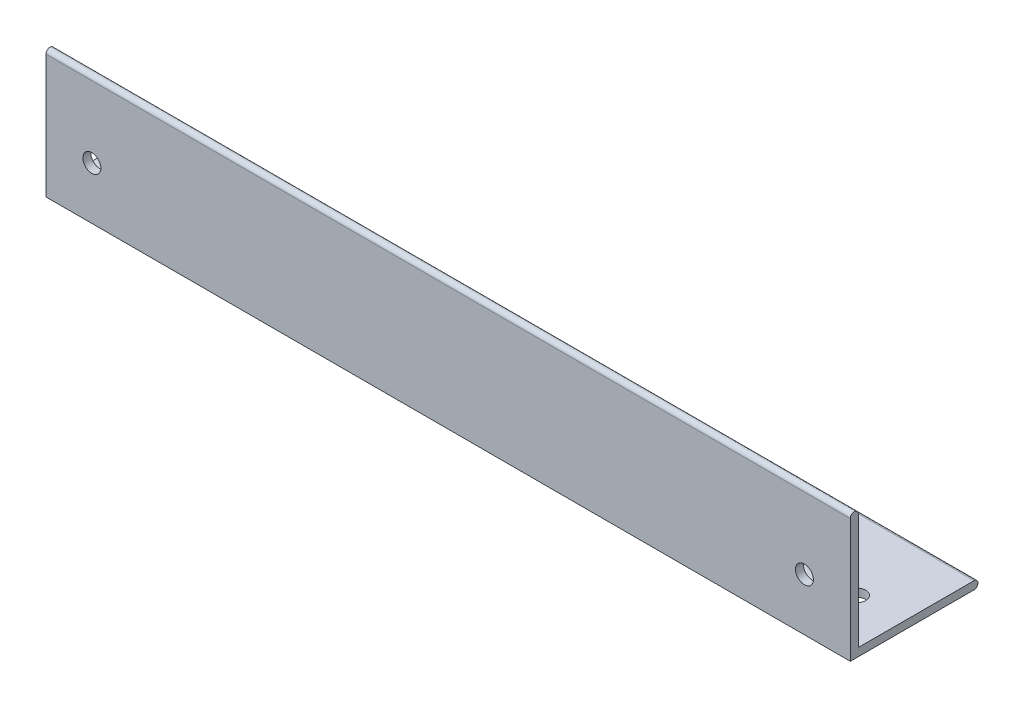
ISO-10303-21;
HEADER;
FILE_DESCRIPTION(('STEP AP214'),'2;1');
FILE_NAME('part.step','',(''),(''),'','','');
FILE_SCHEMA(('AUTOMOTIVE_DESIGN { 1 0 10303 214 1 1 1 1 }'));
ENDSEC;
DATA;
#1=APPLICATION_CONTEXT('core data for automotive mechanical design processes');
#2=APPLICATION_PROTOCOL_DEFINITION('international standard','automotive_design',2000,#1);
#3=PRODUCT_CONTEXT('',#1,'mechanical');
#4=PRODUCT('Part','Part','',(#3));
#5=PRODUCT_RELATED_PRODUCT_CATEGORY('part','',(#4));
#6=PRODUCT_DEFINITION_FORMATION('','',#4);
#7=PRODUCT_DEFINITION_CONTEXT('part definition',#1,'design');
#8=PRODUCT_DEFINITION('design','',#6,#7);
#9=PRODUCT_DEFINITION_SHAPE('','',#8);
#10=(LENGTH_UNIT() NAMED_UNIT(*) SI_UNIT(.MILLI.,.METRE.));
#11=(NAMED_UNIT(*) PLANE_ANGLE_UNIT() SI_UNIT($,.RADIAN.));
#12=(NAMED_UNIT(*) SI_UNIT($,.STERADIAN.) SOLID_ANGLE_UNIT());
#13=UNCERTAINTY_MEASURE_WITH_UNIT(LENGTH_MEASURE(1.E-05),#10,'distance_accuracy_value','');
#14=(GEOMETRIC_REPRESENTATION_CONTEXT(3) GLOBAL_UNCERTAINTY_ASSIGNED_CONTEXT((#13)) GLOBAL_UNIT_ASSIGNED_CONTEXT((#10,
#11,#12)) REPRESENTATION_CONTEXT('',''));
#15=CARTESIAN_POINT('',(0.,0.,0.));
#16=DIRECTION('',(0.,0.,1.));
#17=DIRECTION('',(1.,0.,0.));
#18=AXIS2_PLACEMENT_3D('',#15,#16,#17);
#19=CARTESIAN_POINT('',(160.,0.793749999999999,-24.60625));
#20=DIRECTION('',(-1.,0.,0.));
#21=DIRECTION('',(0.,0.,1.));
#22=AXIS2_PLACEMENT_3D('',#19,#20,#21);
#23=CYLINDRICAL_SURFACE('',#22,0.793749999999999);
#24=DIRECTION('',(-1.,0.,0.));
#25=VECTOR('',#24,1.);
#26=CARTESIAN_POINT('',(160.,1.5875,-24.60625));
#27=LINE('',#26,#25);
#28=CARTESIAN_POINT('',(160.,1.5875,-24.60625));
#29=VERTEX_POINT('',#28);
#30=CARTESIAN_POINT('',(0.,1.5875,-24.60625));
#31=VERTEX_POINT('',#30);
#32=EDGE_CURVE('E154',#29,#31,#27,.T.);
#33=ORIENTED_EDGE('',*,*,#32,.F.);
#34=CARTESIAN_POINT('',(160.,0.793749999999999,-24.60625));
#35=DIRECTION('',(-1.,0.,0.));
#36=DIRECTION('',(0.,0.,1.));
#37=AXIS2_PLACEMENT_3D('',#34,#35,#36);
#38=CIRCLE('',#37,0.793749999999999);
#39=CARTESIAN_POINT('',(160.,0.,-24.60625));
#40=VERTEX_POINT('',#39);
#41=EDGE_CURVE('E51',#40,#29,#38,.F.);
#42=ORIENTED_EDGE('',*,*,#41,.F.);
#43=DIRECTION('',(-1.,0.,0.));
#44=VECTOR('',#43,1.);
#45=CARTESIAN_POINT('',(160.,0.,-24.60625));
#46=LINE('',#45,#44);
#47=CARTESIAN_POINT('',(0.,0.,-24.60625));
#48=VERTEX_POINT('',#47);
#49=EDGE_CURVE('E157',#48,#40,#46,.F.);
#50=ORIENTED_EDGE('',*,*,#49,.F.);
#51=CARTESIAN_POINT('',(0.,0.793749999999999,-24.60625));
#52=DIRECTION('',(-1.,0.,0.));
#53=DIRECTION('',(0.,0.,1.));
#54=AXIS2_PLACEMENT_3D('',#51,#52,#53);
#55=CIRCLE('',#54,0.793749999999999);
#56=EDGE_CURVE('E11',#31,#48,#55,.T.);
#57=ORIENTED_EDGE('',*,*,#56,.F.);
#58=EDGE_LOOP('',(#33,#42,#50,#57));
#59=FACE_BOUND('',#58,.T.);
#60=ADVANCED_FACE('F41',(#59),#23,.T.);
#61=CARTESIAN_POINT('',(160.,24.60625,-0.79375));
#62=DIRECTION('',(-1.,0.,0.));
#63=DIRECTION('',(0.,0.,1.));
#64=AXIS2_PLACEMENT_3D('',#61,#62,#63);
#65=CYLINDRICAL_SURFACE('',#64,0.79375);
#66=DIRECTION('',(-1.,0.,0.));
#67=VECTOR('',#66,1.);
#68=CARTESIAN_POINT('',(160.,24.60625,0.));
#69=LINE('',#68,#67);
#70=CARTESIAN_POINT('',(160.,24.60625,0.));
#71=VERTEX_POINT('',#70);
#72=CARTESIAN_POINT('',(0.,24.60625,0.));
#73=VERTEX_POINT('',#72);
#74=EDGE_CURVE('E114',#71,#73,#69,.T.);
#75=ORIENTED_EDGE('',*,*,#74,.F.);
#76=CARTESIAN_POINT('',(160.,24.60625,-0.79375));
#77=DIRECTION('',(-1.,0.,0.));
#78=DIRECTION('',(0.,0.,1.));
#79=AXIS2_PLACEMENT_3D('',#76,#77,#78);
#80=CIRCLE('',#79,0.79375);
#81=CARTESIAN_POINT('',(160.,24.60625,-1.5875));
#82=VERTEX_POINT('',#81);
#83=EDGE_CURVE('E148',#82,#71,#80,.F.);
#84=ORIENTED_EDGE('',*,*,#83,.F.);
#85=DIRECTION('',(-1.,0.,0.));
#86=VECTOR('',#85,1.);
#87=CARTESIAN_POINT('',(160.,24.60625,-1.5875));
#88=LINE('',#87,#86);
#89=CARTESIAN_POINT('',(0.,24.60625,-1.5875));
#90=VERTEX_POINT('',#89);
#91=EDGE_CURVE('E120',#90,#82,#88,.F.);
#92=ORIENTED_EDGE('',*,*,#91,.F.);
#93=CARTESIAN_POINT('',(0.,24.60625,-0.79375));
#94=DIRECTION('',(-1.,0.,0.));
#95=DIRECTION('',(0.,0.,1.));
#96=AXIS2_PLACEMENT_3D('',#93,#94,#95);
#97=CIRCLE('',#96,0.79375);
#98=EDGE_CURVE('E151',#73,#90,#97,.T.);
#99=ORIENTED_EDGE('',*,*,#98,.F.);
#100=EDGE_LOOP('',(#75,#84,#92,#99));
#101=FACE_BOUND('',#100,.T.);
#102=ADVANCED_FACE('F192',(#101),#65,.T.);
#103=CARTESIAN_POINT('',(160.,0.,-25.4));
#104=DIRECTION('',(0.,1.,0.));
#105=DIRECTION('',(0.,0.,1.));
#106=AXIS2_PLACEMENT_3D('',#103,#104,#105);
#107=PLANE('',#106);
#108=CARTESIAN_POINT('',(9.13,0.,-10.41));
#109=DIRECTION('',(0.,-1.,0.));
#110=DIRECTION('',(0.,0.,1.));
#111=AXIS2_PLACEMENT_3D('',#108,#109,#110);
#112=CIRCLE('',#111,1.785);
#113=CARTESIAN_POINT('',(9.13,0.,-8.625));
#114=VERTEX_POINT('',#113);
#115=EDGE_CURVE('E164',#114,#114,#112,.T.);
#116=ORIENTED_EDGE('',*,*,#115,.F.);
#117=EDGE_LOOP('',(#116));
#118=FACE_BOUND('',#117,.T.);
#119=CARTESIAN_POINT('',(150.87,0.,-10.41));
#120=DIRECTION('',(0.,-1.,0.));
#121=DIRECTION('',(0.,0.,-1.));
#122=AXIS2_PLACEMENT_3D('',#119,#120,#121);
#123=CIRCLE('',#122,1.78500000000001);
#124=CARTESIAN_POINT('',(150.87,0.,-12.195));
#125=VERTEX_POINT('',#124);
#126=EDGE_CURVE('E171',#125,#125,#123,.T.);
#127=ORIENTED_EDGE('',*,*,#126,.F.);
#128=EDGE_LOOP('',(#127));
#129=FACE_BOUND('',#128,.T.);
#130=DIRECTION('',(0.,0.,-1.));
#131=VECTOR('',#130,1.);
#132=CARTESIAN_POINT('',(0.,0.,-25.4));
#133=LINE('',#132,#131);
#134=CARTESIAN_POINT('',(0.,0.,0.));
#135=VERTEX_POINT('',#134);
#136=EDGE_CURVE('E128',#135,#48,#133,.T.);
#137=ORIENTED_EDGE('',*,*,#136,.T.);
#138=ORIENTED_EDGE('',*,*,#49,.T.);
#139=DIRECTION('',(0.,0.,-1.));
#140=VECTOR('',#139,1.);
#141=CARTESIAN_POINT('',(160.,0.,-25.4));
#142=LINE('',#141,#140);
#143=CARTESIAN_POINT('',(160.,0.,0.));
#144=VERTEX_POINT('',#143);
#145=EDGE_CURVE('E104',#144,#40,#142,.T.);
#146=ORIENTED_EDGE('',*,*,#145,.F.);
#147=DIRECTION('',(-1.,0.,0.));
#148=VECTOR('',#147,1.);
#149=CARTESIAN_POINT('',(160.,0.,0.));
#150=LINE('',#149,#148);
#151=EDGE_CURVE('E115',#144,#135,#150,.T.);
#152=ORIENTED_EDGE('',*,*,#151,.T.);
#153=EDGE_LOOP('',(#137,#138,#146,#152));
#154=FACE_BOUND('',#153,.T.);
#155=ADVANCED_FACE('F187',(#118,#129,#154),#107,.F.);
#156=CARTESIAN_POINT('',(160.,1.5875,-1.5875));
#157=DIRECTION('',(0.,-1.,0.));
#158=DIRECTION('',(0.,0.,-1.));
#159=AXIS2_PLACEMENT_3D('',#156,#157,#158);
#160=PLANE('',#159);
#161=CARTESIAN_POINT('',(9.13,1.5875,-10.41));
#162=DIRECTION('',(0.,-1.,0.));
#163=DIRECTION('',(0.,0.,-1.));
#164=AXIS2_PLACEMENT_3D('',#161,#162,#163);
#165=CIRCLE('',#164,1.785);
#166=CARTESIAN_POINT('',(9.13,1.5875,-12.195));
#167=VERTEX_POINT('',#166);
#168=EDGE_CURVE('E45',#167,#167,#165,.T.);
#169=ORIENTED_EDGE('',*,*,#168,.T.);
#170=EDGE_LOOP('',(#169));
#171=FACE_BOUND('',#170,.T.);
#172=CARTESIAN_POINT('',(150.87,1.5875,-10.41));
#173=DIRECTION('',(0.,-1.,0.));
#174=DIRECTION('',(0.,0.,-1.));
#175=AXIS2_PLACEMENT_3D('',#172,#173,#174);
#176=CIRCLE('',#175,1.78500000000001);
#177=CARTESIAN_POINT('',(150.87,1.5875,-12.195));
#178=VERTEX_POINT('',#177);
#179=EDGE_CURVE('E161',#178,#178,#176,.T.);
#180=ORIENTED_EDGE('',*,*,#179,.T.);
#181=EDGE_LOOP('',(#180));
#182=FACE_BOUND('',#181,.T.);
#183=DIRECTION('',(0.,0.,1.));
#184=VECTOR('',#183,1.);
#185=CARTESIAN_POINT('',(160.,1.5875,-1.5875));
#186=LINE('',#185,#184);
#187=CARTESIAN_POINT('',(160.,1.5875,-1.5875));
#188=VERTEX_POINT('',#187);
#189=EDGE_CURVE('E95',#29,#188,#186,.T.);
#190=ORIENTED_EDGE('',*,*,#189,.F.);
#191=ORIENTED_EDGE('',*,*,#32,.T.);
#192=DIRECTION('',(0.,0.,1.));
#193=VECTOR('',#192,1.);
#194=CARTESIAN_POINT('',(0.,1.5875,-1.5875));
#195=LINE('',#194,#193);
#196=CARTESIAN_POINT('',(0.,1.5875,-1.5875));
#197=VERTEX_POINT('',#196);
#198=EDGE_CURVE('E109',#31,#197,#195,.T.);
#199=ORIENTED_EDGE('',*,*,#198,.T.);
#200=DIRECTION('',(-1.,0.,0.));
#201=VECTOR('',#200,1.);
#202=CARTESIAN_POINT('',(160.,1.5875,-1.5875));
#203=LINE('',#202,#201);
#204=EDGE_CURVE('E107',#188,#197,#203,.T.);
#205=ORIENTED_EDGE('',*,*,#204,.F.);
#206=EDGE_LOOP('',(#190,#191,#199,#205));
#207=FACE_BOUND('',#206,.T.);
#208=ADVANCED_FACE('F108',(#171,#182,#207),#160,.F.);
#209=CARTESIAN_POINT('',(160.,25.4,-1.5875));
#210=DIRECTION('',(0.,0.,1.));
#211=DIRECTION('',(0.,-1.,0.));
#212=AXIS2_PLACEMENT_3D('',#209,#210,#211);
#213=PLANE('',#212);
#214=CARTESIAN_POINT('',(9.13,10.41,-1.5875));
#215=DIRECTION('',(0.,0.,1.));
#216=DIRECTION('',(0.,1.,0.));
#217=AXIS2_PLACEMENT_3D('',#214,#215,#216);
#218=CIRCLE('',#217,1.78500000000001);
#219=CARTESIAN_POINT('',(9.13,12.195,-1.5875));
#220=VERTEX_POINT('',#219);
#221=EDGE_CURVE('E293',#220,#220,#218,.T.);
#222=ORIENTED_EDGE('',*,*,#221,.T.);
#223=EDGE_LOOP('',(#222));
#224=FACE_BOUND('',#223,.T.);
#225=CARTESIAN_POINT('',(150.87,10.41,-1.5875));
#226=DIRECTION('',(0.,0.,-1.));
#227=DIRECTION('',(0.,1.,0.));
#228=AXIS2_PLACEMENT_3D('',#225,#226,#227);
#229=CIRCLE('',#228,1.78500000000001);
#230=CARTESIAN_POINT('',(150.87,12.195,-1.5875));
#231=VERTEX_POINT('',#230);
#232=EDGE_CURVE('E180',#231,#231,#229,.T.);
#233=ORIENTED_EDGE('',*,*,#232,.F.);
#234=EDGE_LOOP('',(#233));
#235=FACE_BOUND('',#234,.T.);
#236=DIRECTION('',(0.,1.,0.));
#237=VECTOR('',#236,1.);
#238=CARTESIAN_POINT('',(0.,25.4,-1.5875));
#239=LINE('',#238,#237);
#240=EDGE_CURVE('E134',#197,#90,#239,.T.);
#241=ORIENTED_EDGE('',*,*,#240,.T.);
#242=ORIENTED_EDGE('',*,*,#91,.T.);
#243=DIRECTION('',(0.,1.,0.));
#244=VECTOR('',#243,1.);
#245=CARTESIAN_POINT('',(160.,25.4,-1.5875));
#246=LINE('',#245,#244);
#247=EDGE_CURVE('E100',#188,#82,#246,.T.);
#248=ORIENTED_EDGE('',*,*,#247,.F.);
#249=ORIENTED_EDGE('',*,*,#204,.T.);
#250=EDGE_LOOP('',(#241,#242,#248,#249));
#251=FACE_BOUND('',#250,.T.);
#252=ADVANCED_FACE('F118',(#224,#235,#251),#213,.F.);
#253=CARTESIAN_POINT('',(160.,0.,0.));
#254=DIRECTION('',(0.,0.,-1.));
#255=DIRECTION('',(-1.,0.,0.));
#256=AXIS2_PLACEMENT_3D('',#253,#254,#255);
#257=PLANE('',#256);
#258=CARTESIAN_POINT('',(9.13,10.41,0.));
#259=DIRECTION('',(0.,0.,1.));
#260=DIRECTION('',(0.,1.,0.));
#261=AXIS2_PLACEMENT_3D('',#258,#259,#260);
#262=CIRCLE('',#261,1.78500000000001);
#263=CARTESIAN_POINT('',(9.13,12.195,0.));
#264=VERTEX_POINT('',#263);
#265=EDGE_CURVE('E290',#264,#264,#262,.T.);
#266=ORIENTED_EDGE('',*,*,#265,.F.);
#267=EDGE_LOOP('',(#266));
#268=FACE_BOUND('',#267,.T.);
#269=CARTESIAN_POINT('',(150.87,10.41,0.));
#270=DIRECTION('',(0.,0.,-1.));
#271=DIRECTION('',(0.,1.,0.));
#272=AXIS2_PLACEMENT_3D('',#269,#270,#271);
#273=CIRCLE('',#272,1.78500000000001);
#274=CARTESIAN_POINT('',(150.87,12.195,0.));
#275=VERTEX_POINT('',#274);
#276=EDGE_CURVE('E177',#275,#275,#273,.T.);
#277=ORIENTED_EDGE('',*,*,#276,.T.);
#278=EDGE_LOOP('',(#277));
#279=FACE_BOUND('',#278,.T.);
#280=DIRECTION('',(0.,-1.,0.));
#281=VECTOR('',#280,1.);
#282=CARTESIAN_POINT('',(160.,0.,0.));
#283=LINE('',#282,#281);
#284=EDGE_CURVE('E122',#71,#144,#283,.T.);
#285=ORIENTED_EDGE('',*,*,#284,.F.);
#286=ORIENTED_EDGE('',*,*,#74,.T.);
#287=DIRECTION('',(0.,-1.,0.));
#288=VECTOR('',#287,1.);
#289=CARTESIAN_POINT('',(0.,0.,0.));
#290=LINE('',#289,#288);
#291=EDGE_CURVE('E137',#73,#135,#290,.T.);
#292=ORIENTED_EDGE('',*,*,#291,.T.);
#293=ORIENTED_EDGE('',*,*,#151,.F.);
#294=EDGE_LOOP('',(#285,#286,#292,#293));
#295=FACE_BOUND('',#294,.T.);
#296=ADVANCED_FACE('F194',(#268,#279,#295),#257,.F.);
#297=CARTESIAN_POINT('',(160.,0.,0.));
#298=DIRECTION('',(-1.,0.,0.));
#299=DIRECTION('',(0.,0.,1.));
#300=AXIS2_PLACEMENT_3D('',#297,#298,#299);
#301=PLANE('',#300);
#302=ORIENTED_EDGE('',*,*,#145,.T.);
#303=ORIENTED_EDGE('',*,*,#41,.T.);
#304=ORIENTED_EDGE('',*,*,#189,.T.);
#305=ORIENTED_EDGE('',*,*,#247,.T.);
#306=ORIENTED_EDGE('',*,*,#83,.T.);
#307=ORIENTED_EDGE('',*,*,#284,.T.);
#308=EDGE_LOOP('',(#302,#303,#304,#305,#306,#307));
#309=FACE_BOUND('',#308,.T.);
#310=ADVANCED_FACE('F98',(#309),#301,.F.);
#311=CARTESIAN_POINT('',(0.,0.,0.));
#312=DIRECTION('',(-1.,0.,0.));
#313=DIRECTION('',(0.,0.,1.));
#314=AXIS2_PLACEMENT_3D('',#311,#312,#313);
#315=PLANE('',#314);
#316=ORIENTED_EDGE('',*,*,#198,.F.);
#317=ORIENTED_EDGE('',*,*,#56,.T.);
#318=ORIENTED_EDGE('',*,*,#136,.F.);
#319=ORIENTED_EDGE('',*,*,#291,.F.);
#320=ORIENTED_EDGE('',*,*,#98,.T.);
#321=ORIENTED_EDGE('',*,*,#240,.F.);
#322=EDGE_LOOP('',(#316,#317,#318,#319,#320,#321));
#323=FACE_BOUND('',#322,.T.);
#324=ADVANCED_FACE('F188',(#323),#315,.T.);
#325=CARTESIAN_POINT('',(150.87,25.4,-10.41));
#326=DIRECTION('',(0.,-1.,0.));
#327=DIRECTION('',(0.,0.,-1.));
#328=AXIS2_PLACEMENT_3D('',#325,#326,#327);
#329=CYLINDRICAL_SURFACE('',#328,1.78500000000001);
#330=ORIENTED_EDGE('',*,*,#126,.T.);
#331=EDGE_LOOP('',(#330));
#332=FACE_BOUND('',#331,.T.);
#333=ORIENTED_EDGE('',*,*,#179,.F.);
#334=EDGE_LOOP('',(#333));
#335=FACE_BOUND('',#334,.T.);
#336=ADVANCED_FACE('F230',(#332,#335),#329,.F.);
#337=CARTESIAN_POINT('',(9.13,25.4,-10.41));
#338=DIRECTION('',(0.,-1.,0.));
#339=DIRECTION('',(0.,0.,-1.));
#340=AXIS2_PLACEMENT_3D('',#337,#338,#339);
#341=CYLINDRICAL_SURFACE('',#340,1.785);
#342=ORIENTED_EDGE('',*,*,#115,.T.);
#343=EDGE_LOOP('',(#342));
#344=FACE_BOUND('',#343,.T.);
#345=ORIENTED_EDGE('',*,*,#168,.F.);
#346=EDGE_LOOP('',(#345));
#347=FACE_BOUND('',#346,.T.);
#348=ADVANCED_FACE('F227',(#344,#347),#341,.F.);
#349=CARTESIAN_POINT('',(150.87,10.41,0.));
#350=DIRECTION('',(0.,0.,-1.));
#351=DIRECTION('',(0.,1.,0.));
#352=AXIS2_PLACEMENT_3D('',#349,#350,#351);
#353=CYLINDRICAL_SURFACE('',#352,1.78500000000001);
#354=ORIENTED_EDGE('',*,*,#276,.F.);
#355=EDGE_LOOP('',(#354));
#356=FACE_BOUND('',#355,.T.);
#357=ORIENTED_EDGE('',*,*,#232,.T.);
#358=EDGE_LOOP('',(#357));
#359=FACE_BOUND('',#358,.T.);
#360=ADVANCED_FACE('F229',(#356,#359),#353,.F.);
#361=CARTESIAN_POINT('',(9.13,10.41,0.));
#362=DIRECTION('',(0.,0.,-1.));
#363=DIRECTION('',(0.,1.,0.));
#364=AXIS2_PLACEMENT_3D('',#361,#362,#363);
#365=CYLINDRICAL_SURFACE('',#364,1.78500000000001);
#366=ORIENTED_EDGE('',*,*,#265,.T.);
#367=EDGE_LOOP('',(#366));
#368=FACE_BOUND('',#367,.T.);
#369=ORIENTED_EDGE('',*,*,#221,.F.);
#370=EDGE_LOOP('',(#369));
#371=FACE_BOUND('',#370,.T.);
#372=ADVANCED_FACE('F236',(#368,#371),#365,.F.);
#373=CLOSED_SHELL('',(#60,#102,#155,#208,#252,#296,#310,#324,#336,#348,#360,#372));
#374=MANIFOLD_SOLID_BREP('B2',#373);
#375=ADVANCED_BREP_SHAPE_REPRESENTATION('',(#18,#374),#14);
#376=SHAPE_DEFINITION_REPRESENTATION(#9,#375);
ENDSEC;
END-ISO-10303-21;
